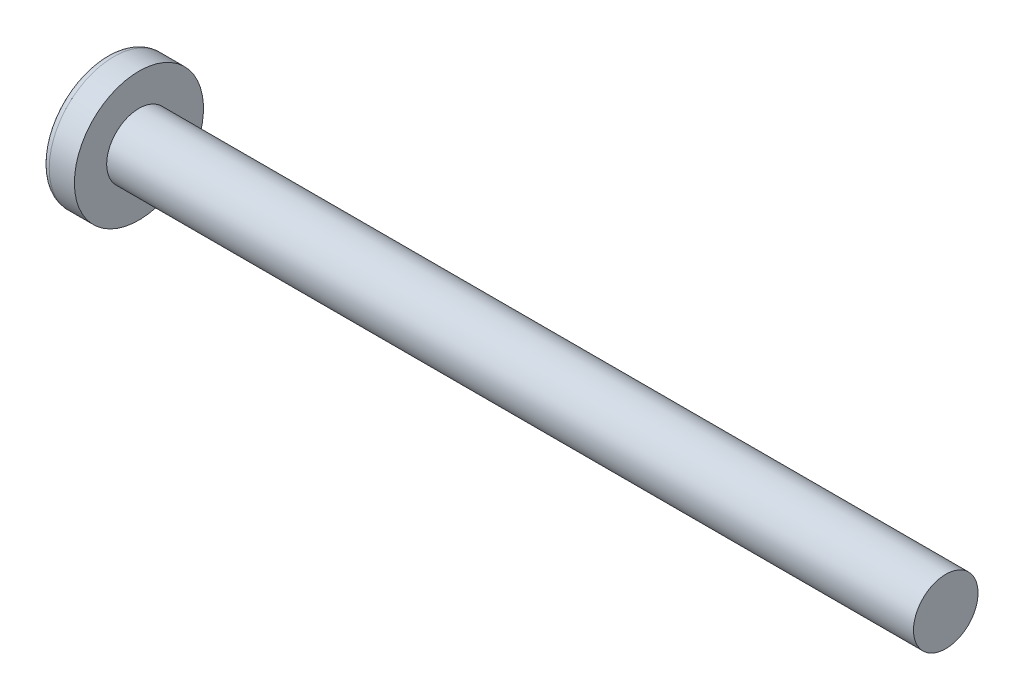
ISO-10303-21;
HEADER;
FILE_DESCRIPTION(('STEP AP214'),'2;1');
FILE_NAME('part.step','',(''),(''),'','','');
FILE_SCHEMA(('AUTOMOTIVE_DESIGN { 1 0 10303 214 1 1 1 1 }'));
ENDSEC;
DATA;
#1=APPLICATION_CONTEXT('core data for automotive mechanical design processes');
#2=APPLICATION_PROTOCOL_DEFINITION('international standard','automotive_design',2000,#1);
#3=PRODUCT_CONTEXT('',#1,'mechanical');
#4=PRODUCT('Part','Part','',(#3));
#5=PRODUCT_RELATED_PRODUCT_CATEGORY('part','',(#4));
#6=PRODUCT_DEFINITION_FORMATION('','',#4);
#7=PRODUCT_DEFINITION_CONTEXT('part definition',#1,'design');
#8=PRODUCT_DEFINITION('design','',#6,#7);
#9=PRODUCT_DEFINITION_SHAPE('','',#8);
#10=(LENGTH_UNIT() NAMED_UNIT(*) SI_UNIT(.MILLI.,.METRE.));
#11=(NAMED_UNIT(*) PLANE_ANGLE_UNIT() SI_UNIT($,.RADIAN.));
#12=(NAMED_UNIT(*) SI_UNIT($,.STERADIAN.) SOLID_ANGLE_UNIT());
#13=UNCERTAINTY_MEASURE_WITH_UNIT(LENGTH_MEASURE(1.E-05),#10,'distance_accuracy_value','');
#14=(GEOMETRIC_REPRESENTATION_CONTEXT(3) GLOBAL_UNCERTAINTY_ASSIGNED_CONTEXT((#13)) GLOBAL_UNIT_ASSIGNED_CONTEXT((#10,
#11,#12)) REPRESENTATION_CONTEXT('',''));
#15=CARTESIAN_POINT('',(0.,0.,0.));
#16=DIRECTION('',(0.,0.,1.));
#17=DIRECTION('',(1.,0.,0.));
#18=AXIS2_PLACEMENT_3D('',#15,#16,#17);
#19=CARTESIAN_POINT('',(3.2,0.,0.));
#20=DIRECTION('',(-1.,0.,0.));
#21=DIRECTION('',(0.,1.,0.));
#22=AXIS2_PLACEMENT_3D('',#19,#20,#21);
#23=SPHERICAL_SURFACE('',#22,3.2);
#24=CARTESIAN_POINT('',(0.62711787578058,0.,0.));
#25=DIRECTION('',(-1.,0.,0.));
#26=DIRECTION('',(0.,0.,1.));
#27=AXIS2_PLACEMENT_3D('',#24,#25,#26);
#28=CIRCLE('',#27,1.9027027027027);
#29=CARTESIAN_POINT('',(0.62711787578058,0.,1.9027027027027));
#30=VERTEX_POINT('',#29);
#31=EDGE_CURVE('E154',#30,#30,#28,.T.);
#32=ORIENTED_EDGE('',*,*,#31,.T.);
#33=EDGE_LOOP('',(#32));
#34=FACE_BOUND('',#33,.T.);
#35=CARTESIAN_POINT('',(3.19174554351625,-0.0818566934638239,0.));
#36=DIRECTION('',(-0.100331502261418,-0.994954064092392,0.));
#37=DIRECTION('',(0.994954064092392,-0.100331502261418,0.));
#38=AXIS2_PLACEMENT_3D('',#35,#36,#37);
#39=CIRCLE('',#38,3.1989422229361);
#40=CARTESIAN_POINT('',(0.118330716626357,0.228067490760365,0.83144431417242));
#41=VERTEX_POINT('',#40);
#42=CARTESIAN_POINT('',(0.0177814447975956,0.238206913129653,0.238206913129654));
#43=VERTEX_POINT('',#42);
#44=EDGE_CURVE('E185',#41,#43,#39,.T.);
#45=ORIENTED_EDGE('',*,*,#44,.F.);
#46=CARTESIAN_POINT('',(2.64043280070581,0.,-0.842892363493775));
#47=DIRECTION('',(0.553083521918191,0.,0.833125811497021));
#48=DIRECTION('',(0.833125811497021,0.,-0.553083521918191));
#49=AXIS2_PLACEMENT_3D('',#46,#47,#48);
#50=CIRCLE('',#49,3.03585523585001);
#51=CARTESIAN_POINT('',(0.118330716626356,-0.22806749076037,0.831444314172418));
#52=VERTEX_POINT('',#51);
#53=EDGE_CURVE('E150',#41,#52,#50,.T.);
#54=ORIENTED_EDGE('',*,*,#53,.T.);
#55=CARTESIAN_POINT('',(3.19174554351625,0.0818566934638237,0.));
#56=DIRECTION('',(-0.100331502261418,0.994954064092392,0.));
#57=DIRECTION('',(-0.994954064092392,-0.100331502261418,0.));
#58=AXIS2_PLACEMENT_3D('',#55,#56,#57);
#59=CIRCLE('',#58,3.1989422229361);
#60=CARTESIAN_POINT('',(0.0177814447975947,-0.238206913129655,0.238206913129654));
#61=VERTEX_POINT('',#60);
#62=EDGE_CURVE('E106',#61,#52,#59,.T.);
#63=ORIENTED_EDGE('',*,*,#62,.F.);
#64=CARTESIAN_POINT('',(3.19174554351625,0.,-0.0818566934638237));
#65=DIRECTION('',(-0.100331502261418,0.,-0.994954064092392));
#66=DIRECTION('',(-0.994954064092392,0.,0.100331502261418));
#67=AXIS2_PLACEMENT_3D('',#64,#65,#66);
#68=CIRCLE('',#67,3.1989422229361);
#69=CARTESIAN_POINT('',(0.118330716626357,-0.831444314172419,0.228067490760367));
#70=VERTEX_POINT('',#69);
#71=EDGE_CURVE('E131',#70,#61,#68,.T.);
#72=ORIENTED_EDGE('',*,*,#71,.F.);
#73=CARTESIAN_POINT('',(2.64043280070581,0.842892363493775,0.));
#74=DIRECTION('',(0.553083521918191,-0.833125811497021,0.));
#75=DIRECTION('',(0.833125811497021,0.553083521918191,0.));
#76=AXIS2_PLACEMENT_3D('',#73,#74,#75);
#77=CIRCLE('',#76,3.03585523585001);
#78=CARTESIAN_POINT('',(0.118330716626356,-0.831444314172419,-0.228067490760367));
#79=VERTEX_POINT('',#78);
#80=EDGE_CURVE('E139',#70,#79,#77,.T.);
#81=ORIENTED_EDGE('',*,*,#80,.T.);
#82=CARTESIAN_POINT('',(3.19174554351625,0.,0.0818566934638239));
#83=DIRECTION('',(-0.100331502261418,0.,0.994954064092392));
#84=DIRECTION('',(0.994954064092392,0.,0.100331502261418));
#85=AXIS2_PLACEMENT_3D('',#82,#83,#84);
#86=CIRCLE('',#85,3.1989422229361);
#87=CARTESIAN_POINT('',(0.0177814447975952,-0.238206913129653,-0.238206913129654));
#88=VERTEX_POINT('',#87);
#89=EDGE_CURVE('E49',#88,#79,#86,.T.);
#90=ORIENTED_EDGE('',*,*,#89,.F.);
#91=CARTESIAN_POINT('',(0.118330716626357,-0.228067490760364,-0.83144431417242));
#92=VERTEX_POINT('',#91);
#93=EDGE_CURVE('E192',#92,#88,#59,.T.);
#94=ORIENTED_EDGE('',*,*,#93,.F.);
#95=CARTESIAN_POINT('',(2.64043280070581,0.,0.842892363493775));
#96=DIRECTION('',(0.553083521918191,0.,-0.833125811497021));
#97=DIRECTION('',(-0.833125811497021,0.,-0.553083521918191));
#98=AXIS2_PLACEMENT_3D('',#95,#96,#97);
#99=CIRCLE('',#98,3.03585523585001);
#100=CARTESIAN_POINT('',(0.118330716626357,0.22806749076037,-0.831444314172418));
#101=VERTEX_POINT('',#100);
#102=EDGE_CURVE('E132',#92,#101,#99,.T.);
#103=ORIENTED_EDGE('',*,*,#102,.T.);
#104=CARTESIAN_POINT('',(0.0177814447975956,0.238206913129655,-0.238206913129654));
#105=VERTEX_POINT('',#104);
#106=EDGE_CURVE('E180',#105,#101,#39,.T.);
#107=ORIENTED_EDGE('',*,*,#106,.F.);
#108=CARTESIAN_POINT('',(0.118330716626356,0.831444314172419,-0.228067490760367));
#109=VERTEX_POINT('',#108);
#110=EDGE_CURVE('E42',#109,#105,#86,.T.);
#111=ORIENTED_EDGE('',*,*,#110,.F.);
#112=CARTESIAN_POINT('',(2.64043280070581,-0.842892363493776,0.));
#113=DIRECTION('',(0.553083521918191,0.833125811497021,0.));
#114=DIRECTION('',(-0.833125811497021,0.553083521918191,0.));
#115=AXIS2_PLACEMENT_3D('',#112,#113,#114);
#116=CIRCLE('',#115,3.03585523585001);
#117=CARTESIAN_POINT('',(0.118330716626357,0.831444314172419,0.228067490760367));
#118=VERTEX_POINT('',#117);
#119=EDGE_CURVE('E11',#109,#118,#116,.T.);
#120=ORIENTED_EDGE('',*,*,#119,.T.);
#121=EDGE_CURVE('E168',#43,#118,#68,.T.);
#122=ORIENTED_EDGE('',*,*,#121,.F.);
#123=EDGE_LOOP('',(#45,#54,#63,#72,#81,#90,#94,#103,#107,#111,#120,#122));
#124=FACE_BOUND('',#123,.T.);
#125=ADVANCED_FACE('F34',(#34,#124),#23,.T.);
#126=CARTESIAN_POINT('',(1.37075949367089,0.,-0.101772151898734));
#127=DIRECTION('',(-0.100331502261418,0.,0.994954064092392));
#128=DIRECTION('',(0.994954064092392,0.,0.100331502261418));
#129=AXIS2_PLACEMENT_3D('',#126,#127,#128);
#130=PLANE('',#129);
#131=ORIENTED_EDGE('',*,*,#110,.T.);
#132=DIRECTION('',(0.989983749746913,-0.0998302940921261,0.0998302940921257));
#133=VECTOR('',#132,1.);
#134=CARTESIAN_POINT('',(1.38081767298512,0.100757881715786,-0.100757881715786));
#135=LINE('',#134,#133);
#136=CARTESIAN_POINT('',(1.19,0.12,-0.12));
#137=VERTEX_POINT('',#136);
#138=EDGE_CURVE('E174',#105,#137,#135,.T.);
#139=ORIENTED_EDGE('',*,*,#138,.T.);
#140=DIRECTION('',(0.830201128729582,-0.551141925795269,0.083717760880294));
#141=VECTOR('',#140,1.);
#142=CARTESIAN_POINT('',(0.,0.91,-0.24));
#143=LINE('',#142,#141);
#144=EDGE_CURVE('E155',#109,#137,#143,.T.);
#145=ORIENTED_EDGE('',*,*,#144,.F.);
#146=EDGE_LOOP('',(#131,#139,#145));
#147=FACE_BOUND('',#146,.T.);
#148=ADVANCED_FACE('F173',(#147),#130,.T.);
#149=DIRECTION('',(0.830201128729582,0.551141925795269,0.083717760880294));
#150=VECTOR('',#149,1.);
#151=CARTESIAN_POINT('',(0.,-0.91,-0.24));
#152=LINE('',#151,#150);
#153=CARTESIAN_POINT('',(1.19,-0.12,-0.12));
#154=VERTEX_POINT('',#153);
#155=EDGE_CURVE('E140',#79,#154,#152,.T.);
#156=ORIENTED_EDGE('',*,*,#155,.T.);
#157=DIRECTION('',(-0.989983749746913,-0.0998302940921253,-0.0998302940921257));
#158=VECTOR('',#157,1.);
#159=CARTESIAN_POINT('',(1.38081767298512,-0.100757881715786,-0.100757881715786));
#160=LINE('',#159,#158);
#161=EDGE_CURVE('E195',#154,#88,#160,.T.);
#162=ORIENTED_EDGE('',*,*,#161,.T.);
#163=ORIENTED_EDGE('',*,*,#89,.T.);
#164=EDGE_LOOP('',(#156,#162,#163));
#165=FACE_BOUND('',#164,.T.);
#166=ADVANCED_FACE('F210',(#165),#130,.T.);
#167=CARTESIAN_POINT('',(1.37075949367089,0.,0.101772151898734));
#168=DIRECTION('',(-0.100331502261418,0.,-0.994954064092392));
#169=DIRECTION('',(-0.994954064092392,0.,0.100331502261418));
#170=AXIS2_PLACEMENT_3D('',#167,#168,#169);
#171=PLANE('',#170);
#172=DIRECTION('',(0.830201128729582,-0.551141925795269,-0.083717760880294));
#173=VECTOR('',#172,1.);
#174=CARTESIAN_POINT('',(0.,0.91,0.24));
#175=LINE('',#174,#173);
#176=CARTESIAN_POINT('',(1.19,0.12,0.12));
#177=VERTEX_POINT('',#176);
#178=EDGE_CURVE('E211',#118,#177,#175,.T.);
#179=ORIENTED_EDGE('',*,*,#178,.T.);
#180=DIRECTION('',(-0.989983749746913,0.0998302940921254,0.0998302940921256));
#181=VECTOR('',#180,1.);
#182=CARTESIAN_POINT('',(1.38081767298512,0.100757881715786,0.100757881715786));
#183=LINE('',#182,#181);
#184=EDGE_CURVE('E189',#177,#43,#183,.T.);
#185=ORIENTED_EDGE('',*,*,#184,.T.);
#186=ORIENTED_EDGE('',*,*,#121,.T.);
#187=EDGE_LOOP('',(#179,#185,#186));
#188=FACE_BOUND('',#187,.T.);
#189=ADVANCED_FACE('F215',(#188),#171,.T.);
#190=ORIENTED_EDGE('',*,*,#71,.T.);
#191=DIRECTION('',(0.989983749746913,0.099830294092126,-0.0998302940921256));
#192=VECTOR('',#191,1.);
#193=CARTESIAN_POINT('',(1.38081767298512,-0.100757881715786,0.100757881715786));
#194=LINE('',#193,#192);
#195=CARTESIAN_POINT('',(1.19,-0.12,0.12));
#196=VERTEX_POINT('',#195);
#197=EDGE_CURVE('E104',#61,#196,#194,.T.);
#198=ORIENTED_EDGE('',*,*,#197,.T.);
#199=DIRECTION('',(0.830201128729582,0.551141925795269,-0.0837177608802938));
#200=VECTOR('',#199,1.);
#201=CARTESIAN_POINT('',(0.,-0.91,0.24));
#202=LINE('',#201,#200);
#203=EDGE_CURVE('E129',#70,#196,#202,.T.);
#204=ORIENTED_EDGE('',*,*,#203,.F.);
#205=EDGE_LOOP('',(#190,#198,#204));
#206=FACE_BOUND('',#205,.T.);
#207=ADVANCED_FACE('F128',(#206),#171,.T.);
#208=CARTESIAN_POINT('',(-25.4,0.,0.));
#209=DIRECTION('',(-1.,0.,0.));
#210=DIRECTION('',(0.,0.,1.));
#211=AXIS2_PLACEMENT_3D('',#208,#209,#210);
#212=CYLINDRICAL_SURFACE('',#211,1.);
#213=CARTESIAN_POINT('',(26.6,0.,0.));
#214=DIRECTION('',(-1.,0.,0.));
#215=DIRECTION('',(0.,0.,1.));
#216=AXIS2_PLACEMENT_3D('',#213,#214,#215);
#217=CIRCLE('',#216,1.);
#218=CARTESIAN_POINT('',(26.6,0.,1.));
#219=VERTEX_POINT('',#218);
#220=EDGE_CURVE('E151',#219,#219,#217,.T.);
#221=ORIENTED_EDGE('',*,*,#220,.T.);
#222=EDGE_LOOP('',(#221));
#223=FACE_BOUND('',#222,.T.);
#224=CARTESIAN_POINT('',(1.6,0.,0.));
#225=DIRECTION('',(-1.,0.,0.));
#226=DIRECTION('',(0.,0.,1.));
#227=AXIS2_PLACEMENT_3D('',#224,#225,#226);
#228=CIRCLE('',#227,1.);
#229=CARTESIAN_POINT('',(1.6,0.,1.));
#230=VERTEX_POINT('',#229);
#231=EDGE_CURVE('E164',#230,#230,#228,.T.);
#232=ORIENTED_EDGE('',*,*,#231,.F.);
#233=EDGE_LOOP('',(#232));
#234=FACE_BOUND('',#233,.T.);
#235=ADVANCED_FACE('F36',(#223,#234),#212,.T.);
#236=CARTESIAN_POINT('',(1.6,1.,0.));
#237=DIRECTION('',(-1.,0.,0.));
#238=DIRECTION('',(0.,0.,1.));
#239=AXIS2_PLACEMENT_3D('',#236,#237,#238);
#240=PLANE('',#239);
#241=CARTESIAN_POINT('',(1.6,0.,0.));
#242=DIRECTION('',(-1.,0.,0.));
#243=DIRECTION('',(0.,0.,1.));
#244=AXIS2_PLACEMENT_3D('',#241,#242,#243);
#245=CIRCLE('',#244,2.);
#246=CARTESIAN_POINT('',(1.6,0.,2.));
#247=VERTEX_POINT('',#246);
#248=EDGE_CURVE('E161',#247,#247,#245,.T.);
#249=ORIENTED_EDGE('',*,*,#248,.F.);
#250=EDGE_LOOP('',(#249));
#251=FACE_BOUND('',#250,.T.);
#252=ORIENTED_EDGE('',*,*,#231,.T.);
#253=EDGE_LOOP('',(#252));
#254=FACE_BOUND('',#253,.T.);
#255=ADVANCED_FACE('F243',(#251,#254),#240,.F.);
#256=CARTESIAN_POINT('',(-25.4,0.,0.));
#257=DIRECTION('',(-1.,0.,0.));
#258=DIRECTION('',(0.,0.,1.));
#259=AXIS2_PLACEMENT_3D('',#256,#257,#258);
#260=CYLINDRICAL_SURFACE('',#259,2.);
#261=ORIENTED_EDGE('',*,*,#248,.T.);
#262=EDGE_LOOP('',(#261));
#263=FACE_BOUND('',#262,.T.);
#264=CARTESIAN_POINT('',(0.820084035097039,0.,0.));
#265=DIRECTION('',(-1.,0.,0.));
#266=DIRECTION('',(0.,0.,1.));
#267=AXIS2_PLACEMENT_3D('',#264,#265,#266);
#268=CIRCLE('',#267,2.);
#269=CARTESIAN_POINT('',(0.820084035097039,0.,2.));
#270=VERTEX_POINT('',#269);
#271=EDGE_CURVE('E158',#270,#270,#268,.T.);
#272=ORIENTED_EDGE('',*,*,#271,.F.);
#273=EDGE_LOOP('',(#272));
#274=FACE_BOUND('',#273,.T.);
#275=ADVANCED_FACE('F240',(#263,#274),#260,.T.);
#276=CARTESIAN_POINT('',(0.820084035097038,0.,0.));
#277=DIRECTION('',(-1.,0.,0.));
#278=DIRECTION('',(0.,0.,1.));
#279=AXIS2_PLACEMENT_3D('',#276,#277,#278);
#280=TOROIDAL_SURFACE('',#279,1.76,0.24);
#281=ORIENTED_EDGE('',*,*,#271,.T.);
#282=EDGE_LOOP('',(#281));
#283=FACE_BOUND('',#282,.T.);
#284=ORIENTED_EDGE('',*,*,#31,.F.);
#285=EDGE_LOOP('',(#284));
#286=FACE_BOUND('',#285,.T.);
#287=ADVANCED_FACE('F237',(#283,#286),#280,.T.);
#288=CARTESIAN_POINT('',(26.6,1.,0.));
#289=DIRECTION('',(1.,0.,0.));
#290=DIRECTION('',(0.,0.,-1.));
#291=AXIS2_PLACEMENT_3D('',#288,#289,#290);
#292=PLANE('',#291);
#293=ORIENTED_EDGE('',*,*,#220,.F.);
#294=EDGE_LOOP('',(#293));
#295=FACE_BOUND('',#294,.T.);
#296=ADVANCED_FACE('F235',(#295),#292,.T.);
#297=CARTESIAN_POINT('',(1.19,0.12,0.12));
#298=DIRECTION('',(0.553083521918191,0.833125811497021,0.));
#299=DIRECTION('',(-0.833125811497021,0.553083521918191,0.));
#300=AXIS2_PLACEMENT_3D('',#297,#298,#299);
#301=PLANE('',#300);
#302=ORIENTED_EDGE('',*,*,#144,.T.);
#303=DIRECTION('',(0.,0.,-1.));
#304=VECTOR('',#303,1.);
#305=CARTESIAN_POINT('',(1.19,0.12,0.12));
#306=LINE('',#305,#304);
#307=EDGE_CURVE('E122',#177,#137,#306,.T.);
#308=ORIENTED_EDGE('',*,*,#307,.F.);
#309=ORIENTED_EDGE('',*,*,#178,.F.);
#310=ORIENTED_EDGE('',*,*,#119,.F.);
#311=EDGE_LOOP('',(#302,#308,#309,#310));
#312=FACE_BOUND('',#311,.T.);
#313=ADVANCED_FACE('F214',(#312),#301,.F.);
#314=CARTESIAN_POINT('',(0.,-0.91,-0.24));
#315=DIRECTION('',(0.553083521918191,-0.833125811497021,0.));
#316=DIRECTION('',(0.833125811497021,0.553083521918191,0.));
#317=AXIS2_PLACEMENT_3D('',#314,#315,#316);
#318=PLANE('',#317);
#319=ORIENTED_EDGE('',*,*,#203,.T.);
#320=DIRECTION('',(0.,0.,1.));
#321=VECTOR('',#320,1.);
#322=CARTESIAN_POINT('',(1.19,-0.12,-0.12));
#323=LINE('',#322,#321);
#324=EDGE_CURVE('E121',#154,#196,#323,.T.);
#325=ORIENTED_EDGE('',*,*,#324,.F.);
#326=ORIENTED_EDGE('',*,*,#155,.F.);
#327=ORIENTED_EDGE('',*,*,#80,.F.);
#328=EDGE_LOOP('',(#319,#325,#326,#327));
#329=FACE_BOUND('',#328,.T.);
#330=ADVANCED_FACE('F136',(#329),#318,.F.);
#331=CARTESIAN_POINT('',(1.19,0.12,-0.12));
#332=DIRECTION('',(-1.,0.,0.));
#333=DIRECTION('',(0.,0.,1.));
#334=AXIS2_PLACEMENT_3D('',#331,#332,#333);
#335=PLANE('',#334);
#336=DIRECTION('',(0.,1.,0.));
#337=VECTOR('',#336,1.);
#338=CARTESIAN_POINT('',(1.19,-0.12,-0.12));
#339=LINE('',#338,#337);
#340=EDGE_CURVE('E144',#154,#137,#339,.T.);
#341=ORIENTED_EDGE('',*,*,#340,.F.);
#342=ORIENTED_EDGE('',*,*,#324,.T.);
#343=DIRECTION('',(0.,-1.,0.));
#344=VECTOR('',#343,1.);
#345=CARTESIAN_POINT('',(1.19,0.12,0.12));
#346=LINE('',#345,#344);
#347=EDGE_CURVE('E113',#177,#196,#346,.T.);
#348=ORIENTED_EDGE('',*,*,#347,.F.);
#349=ORIENTED_EDGE('',*,*,#307,.T.);
#350=EDGE_LOOP('',(#341,#342,#348,#349));
#351=FACE_BOUND('',#350,.T.);
#352=ADVANCED_FACE('F142',(#351),#335,.T.);
#353=CARTESIAN_POINT('',(0.,0.240000000000003,-0.909999999999999));
#354=DIRECTION('',(0.553083521918191,0.,-0.833125811497021));
#355=DIRECTION('',(0.833125811497021,0.,0.553083521918191));
#356=AXIS2_PLACEMENT_3D('',#353,#354,#355);
#357=PLANE('',#356);
#358=DIRECTION('',(0.830201128729582,0.0837177608802919,0.551141925795269));
#359=VECTOR('',#358,1.);
#360=CARTESIAN_POINT('',(0.,-0.239999999999997,-0.910000000000001));
#361=LINE('',#360,#359);
#362=EDGE_CURVE('E200',#92,#154,#361,.T.);
#363=ORIENTED_EDGE('',*,*,#362,.T.);
#364=ORIENTED_EDGE('',*,*,#340,.T.);
#365=DIRECTION('',(0.830201128729582,-0.0837177608802959,0.551141925795269));
#366=VECTOR('',#365,1.);
#367=CARTESIAN_POINT('',(0.,0.240000000000003,-0.909999999999999));
#368=LINE('',#367,#366);
#369=EDGE_CURVE('E110',#101,#137,#368,.T.);
#370=ORIENTED_EDGE('',*,*,#369,.F.);
#371=ORIENTED_EDGE('',*,*,#102,.F.);
#372=EDGE_LOOP('',(#363,#364,#370,#371));
#373=FACE_BOUND('',#372,.T.);
#374=ADVANCED_FACE('F205',(#373),#357,.F.);
#375=CARTESIAN_POINT('',(1.37075949367089,-0.101772151898734,0.));
#376=DIRECTION('',(-0.100331502261418,0.994954064092392,0.));
#377=DIRECTION('',(-0.994954064092392,-0.100331502261418,0.));
#378=AXIS2_PLACEMENT_3D('',#375,#376,#377);
#379=PLANE('',#378);
#380=ORIENTED_EDGE('',*,*,#93,.T.);
#381=ORIENTED_EDGE('',*,*,#161,.F.);
#382=ORIENTED_EDGE('',*,*,#362,.F.);
#383=EDGE_LOOP('',(#380,#381,#382));
#384=FACE_BOUND('',#383,.T.);
#385=ADVANCED_FACE('F209',(#384),#379,.T.);
#386=CARTESIAN_POINT('',(1.37075949367089,0.101772151898734,0.));
#387=DIRECTION('',(-0.100331502261418,-0.994954064092392,0.));
#388=DIRECTION('',(0.994954064092392,-0.100331502261418,0.));
#389=AXIS2_PLACEMENT_3D('',#386,#387,#388);
#390=PLANE('',#389);
#391=ORIENTED_EDGE('',*,*,#106,.T.);
#392=ORIENTED_EDGE('',*,*,#369,.T.);
#393=ORIENTED_EDGE('',*,*,#138,.F.);
#394=EDGE_LOOP('',(#391,#392,#393));
#395=FACE_BOUND('',#394,.T.);
#396=ADVANCED_FACE('F203',(#395),#390,.T.);
#397=CARTESIAN_POINT('',(1.19,-0.12,0.12));
#398=DIRECTION('',(0.553083521918191,0.,0.833125811497021));
#399=DIRECTION('',(-0.833125811497021,0.,0.553083521918191));
#400=AXIS2_PLACEMENT_3D('',#397,#398,#399);
#401=PLANE('',#400);
#402=DIRECTION('',(0.830201128729582,-0.0837177608802921,-0.551141925795269));
#403=VECTOR('',#402,1.);
#404=CARTESIAN_POINT('',(0.,0.239999999999997,0.910000000000001));
#405=LINE('',#404,#403);
#406=EDGE_CURVE('E109',#41,#177,#405,.T.);
#407=ORIENTED_EDGE('',*,*,#406,.T.);
#408=ORIENTED_EDGE('',*,*,#347,.T.);
#409=DIRECTION('',(0.830201128729582,0.0837177608802959,-0.551141925795269));
#410=VECTOR('',#409,1.);
#411=CARTESIAN_POINT('',(0.,-0.240000000000003,0.909999999999999));
#412=LINE('',#411,#410);
#413=EDGE_CURVE('E100',#52,#196,#412,.T.);
#414=ORIENTED_EDGE('',*,*,#413,.F.);
#415=ORIENTED_EDGE('',*,*,#53,.F.);
#416=EDGE_LOOP('',(#407,#408,#414,#415));
#417=FACE_BOUND('',#416,.T.);
#418=ADVANCED_FACE('F114',(#417),#401,.F.);
#419=ORIENTED_EDGE('',*,*,#44,.T.);
#420=ORIENTED_EDGE('',*,*,#184,.F.);
#421=ORIENTED_EDGE('',*,*,#406,.F.);
#422=EDGE_LOOP('',(#419,#420,#421));
#423=FACE_BOUND('',#422,.T.);
#424=ADVANCED_FACE('F216',(#423),#390,.T.);
#425=ORIENTED_EDGE('',*,*,#62,.T.);
#426=ORIENTED_EDGE('',*,*,#413,.T.);
#427=ORIENTED_EDGE('',*,*,#197,.F.);
#428=EDGE_LOOP('',(#425,#426,#427));
#429=FACE_BOUND('',#428,.T.);
#430=ADVANCED_FACE('F102',(#429),#379,.T.);
#431=CLOSED_SHELL('',(#125,#148,#166,#189,#207,#235,#255,#275,#287,#296,#313,#330,#352,#374,
#385,#396,#418,#424,#430));
#432=MANIFOLD_SOLID_BREP('B2',#431);
#433=ADVANCED_BREP_SHAPE_REPRESENTATION('',(#18,#432),#14);
#434=SHAPE_DEFINITION_REPRESENTATION(#9,#433);
ENDSEC;
END-ISO-10303-21;
